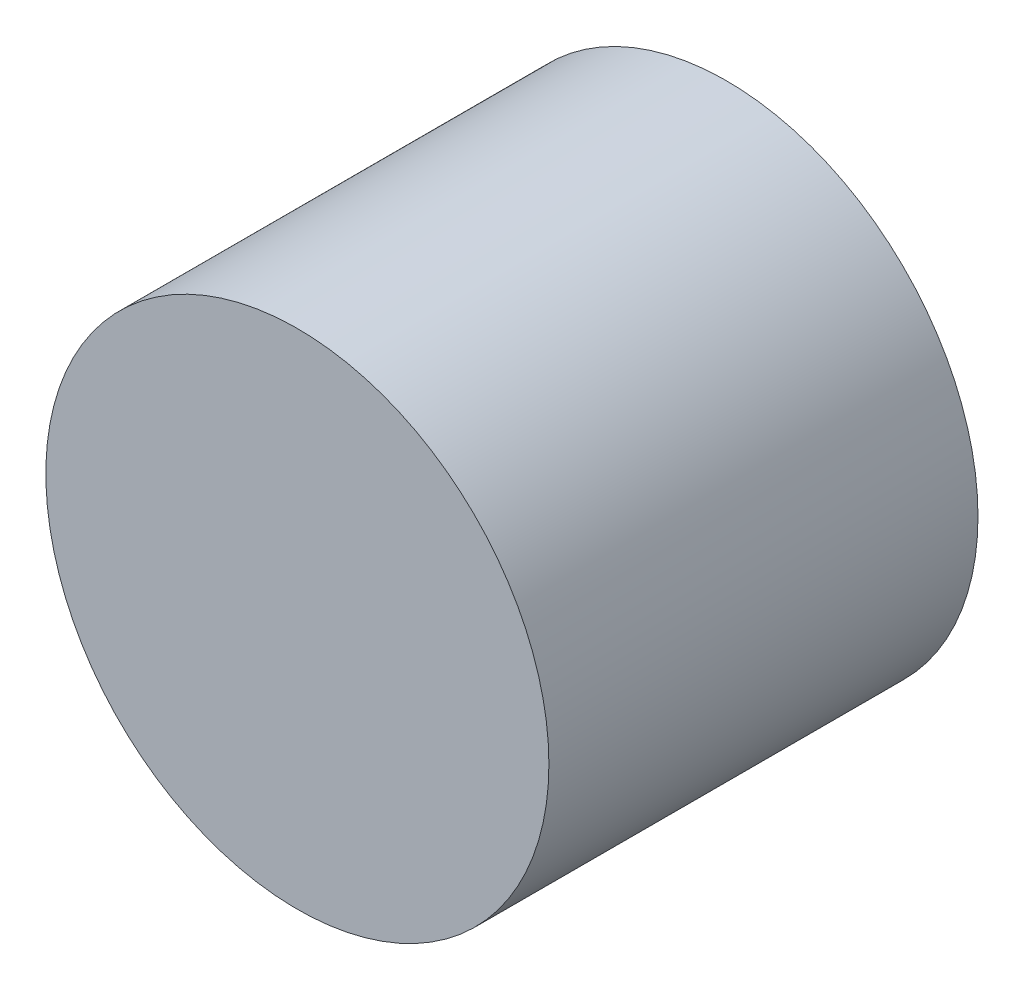
ISO-10303-21;
HEADER;
FILE_DESCRIPTION(('STEP AP214'),'2;1');
FILE_NAME('part.step','',(''),(''),'','','');
FILE_SCHEMA(('AUTOMOTIVE_DESIGN { 1 0 10303 214 1 1 1 1 }'));
ENDSEC;
DATA;
#1=APPLICATION_CONTEXT('core data for automotive mechanical design processes');
#2=APPLICATION_PROTOCOL_DEFINITION('international standard','automotive_design',2000,#1);
#3=PRODUCT_CONTEXT('',#1,'mechanical');
#4=PRODUCT('Part','Part','',(#3));
#5=PRODUCT_RELATED_PRODUCT_CATEGORY('part','',(#4));
#6=PRODUCT_DEFINITION_FORMATION('','',#4);
#7=PRODUCT_DEFINITION_CONTEXT('part definition',#1,'design');
#8=PRODUCT_DEFINITION('design','',#6,#7);
#9=PRODUCT_DEFINITION_SHAPE('','',#8);
#10=(LENGTH_UNIT() NAMED_UNIT(*) SI_UNIT(.MILLI.,.METRE.));
#11=(NAMED_UNIT(*) PLANE_ANGLE_UNIT() SI_UNIT($,.RADIAN.));
#12=(NAMED_UNIT(*) SI_UNIT($,.STERADIAN.) SOLID_ANGLE_UNIT());
#13=UNCERTAINTY_MEASURE_WITH_UNIT(LENGTH_MEASURE(1.E-05),#10,'distance_accuracy_value','');
#14=(GEOMETRIC_REPRESENTATION_CONTEXT(3) GLOBAL_UNCERTAINTY_ASSIGNED_CONTEXT((#13)) GLOBAL_UNIT_ASSIGNED_CONTEXT((#10,
#11,#12)) REPRESENTATION_CONTEXT('',''));
#15=CARTESIAN_POINT('',(0.,0.,0.));
#16=DIRECTION('',(0.,0.,1.));
#17=DIRECTION('',(1.,0.,0.));
#18=AXIS2_PLACEMENT_3D('',#15,#16,#17);
#19=CARTESIAN_POINT('',(0.,0.,14.5));
#20=DIRECTION('',(0.,0.,-1.));
#21=DIRECTION('',(-1.,0.,0.));
#22=AXIS2_PLACEMENT_3D('',#19,#20,#21);
#23=CYLINDRICAL_SURFACE('',#22,8.5);
#24=CARTESIAN_POINT('',(0.,0.,14.5));
#25=DIRECTION('',(0.,0.,1.));
#26=DIRECTION('',(1.,0.,0.));
#27=AXIS2_PLACEMENT_3D('',#24,#25,#26);
#28=CIRCLE('',#27,8.5);
#29=CARTESIAN_POINT('',(8.5,0.,14.5));
#30=VERTEX_POINT('',#29);
#31=EDGE_CURVE('E10',#30,#30,#28,.T.);
#32=ORIENTED_EDGE('',*,*,#31,.F.);
#33=EDGE_LOOP('',(#32));
#34=FACE_BOUND('',#33,.T.);
#35=CARTESIAN_POINT('',(0.,0.,0.));
#36=DIRECTION('',(0.,0.,1.));
#37=DIRECTION('',(1.,0.,0.));
#38=AXIS2_PLACEMENT_3D('',#35,#36,#37);
#39=CIRCLE('',#38,8.5);
#40=CARTESIAN_POINT('',(8.5,0.,0.));
#41=VERTEX_POINT('',#40);
#42=EDGE_CURVE('E40',#41,#41,#39,.T.);
#43=ORIENTED_EDGE('',*,*,#42,.T.);
#44=EDGE_LOOP('',(#43));
#45=FACE_BOUND('',#44,.T.);
#46=ADVANCED_FACE('F37',(#34,#45),#23,.T.);
#47=CARTESIAN_POINT('',(0.,0.,14.5));
#48=DIRECTION('',(0.,0.,1.));
#49=DIRECTION('',(1.,0.,0.));
#50=AXIS2_PLACEMENT_3D('',#47,#48,#49);
#51=PLANE('',#50);
#52=ORIENTED_EDGE('',*,*,#31,.T.);
#53=EDGE_LOOP('',(#52));
#54=FACE_BOUND('',#53,.T.);
#55=ADVANCED_FACE('F54',(#54),#51,.T.);
#56=CARTESIAN_POINT('',(0.,0.,0.));
#57=DIRECTION('',(0.,0.,1.));
#58=DIRECTION('',(1.,0.,0.));
#59=AXIS2_PLACEMENT_3D('',#56,#57,#58);
#60=PLANE('',#59);
#61=ORIENTED_EDGE('',*,*,#42,.F.);
#62=EDGE_LOOP('',(#61));
#63=FACE_BOUND('',#62,.T.);
#64=ADVANCED_FACE('F52',(#63),#60,.F.);
#65=CLOSED_SHELL('',(#46,#55,#64));
#66=MANIFOLD_SOLID_BREP('B2',#65);
#67=ADVANCED_BREP_SHAPE_REPRESENTATION('',(#18,#66),#14);
#68=SHAPE_DEFINITION_REPRESENTATION(#9,#67);
ENDSEC;
END-ISO-10303-21;
